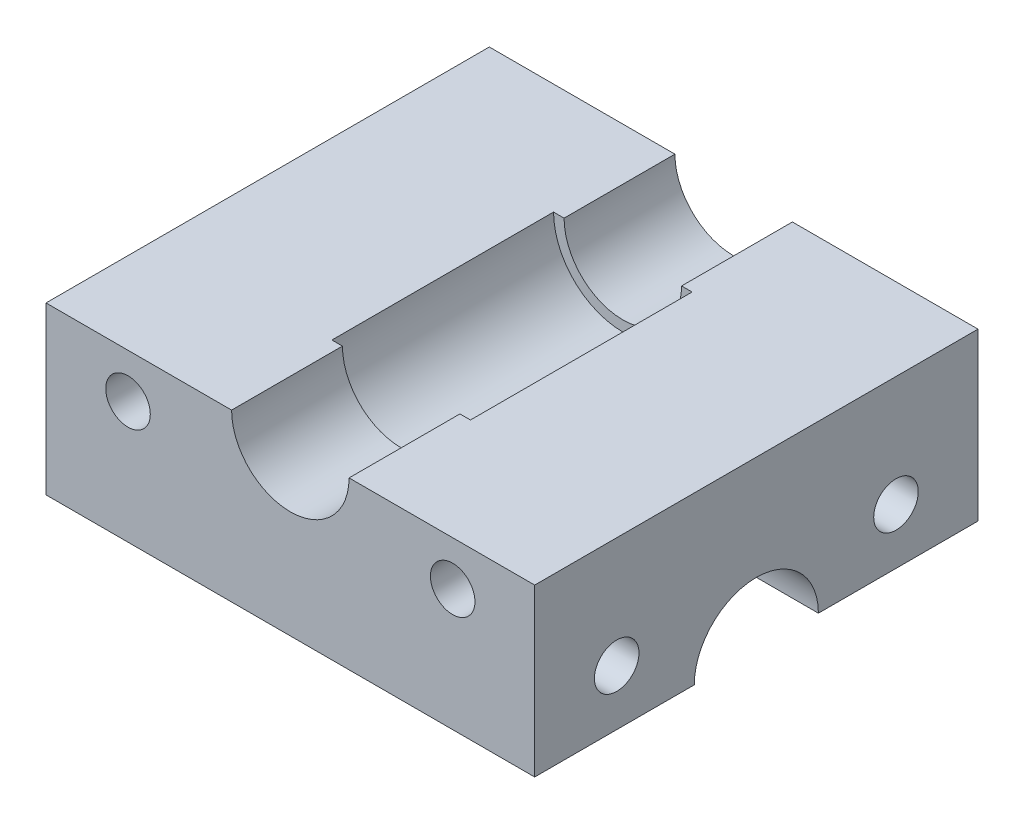
ISO-10303-21;
HEADER;
FILE_DESCRIPTION(('STEP AP214'),'2;1');
FILE_NAME('part.step','',(''),(''),'','','');
FILE_SCHEMA(('AUTOMOTIVE_DESIGN { 1 0 10303 214 1 1 1 1 }'));
ENDSEC;
DATA;
#1=APPLICATION_CONTEXT('core data for automotive mechanical design processes');
#2=APPLICATION_PROTOCOL_DEFINITION('international standard','automotive_design',2000,#1);
#3=PRODUCT_CONTEXT('',#1,'mechanical');
#4=PRODUCT('Part','Part','',(#3));
#5=PRODUCT_RELATED_PRODUCT_CATEGORY('part','',(#4));
#6=PRODUCT_DEFINITION_FORMATION('','',#4);
#7=PRODUCT_DEFINITION_CONTEXT('part definition',#1,'design');
#8=PRODUCT_DEFINITION('design','',#6,#7);
#9=PRODUCT_DEFINITION_SHAPE('','',#8);
#10=(LENGTH_UNIT() NAMED_UNIT(*) SI_UNIT(.MILLI.,.METRE.));
#11=(NAMED_UNIT(*) PLANE_ANGLE_UNIT() SI_UNIT($,.RADIAN.));
#12=(NAMED_UNIT(*) SI_UNIT($,.STERADIAN.) SOLID_ANGLE_UNIT());
#13=UNCERTAINTY_MEASURE_WITH_UNIT(LENGTH_MEASURE(1.E-05),#10,'distance_accuracy_value','');
#14=(GEOMETRIC_REPRESENTATION_CONTEXT(3) GLOBAL_UNCERTAINTY_ASSIGNED_CONTEXT((#13)) GLOBAL_UNIT_ASSIGNED_CONTEXT((#10,
#11,#12)) REPRESENTATION_CONTEXT('',''));
#15=CARTESIAN_POINT('',(0.,0.,0.));
#16=DIRECTION('',(0.,0.,1.));
#17=DIRECTION('',(1.,0.,0.));
#18=AXIS2_PLACEMENT_3D('',#15,#16,#17);
#19=CARTESIAN_POINT('',(-10.9940298507463,-2.47667711691045,50.8));
#20=DIRECTION('',(0.,1.,0.));
#21=DIRECTION('',(0.,0.,1.));
#22=AXIS2_PLACEMENT_3D('',#19,#20,#21);
#23=PLANE('',#22);
#24=DIRECTION('',(0.,0.,-1.));
#25=VECTOR('',#24,1.);
#26=CARTESIAN_POINT('',(-10.9940298507463,-2.47667711691045,50.8));
#27=LINE('',#26,#25);
#28=CARTESIAN_POINT('',(-10.9940298507463,-2.47667711691045,50.8));
#29=VERTEX_POINT('',#28);
#30=CARTESIAN_POINT('',(-10.9940298507463,-2.47667711691045,32.512));
#31=VERTEX_POINT('',#30);
#32=EDGE_CURVE('E132',#29,#31,#27,.T.);
#33=ORIENTED_EDGE('',*,*,#32,.T.);
#34=DIRECTION('',(1.,0.,0.));
#35=VECTOR('',#34,1.);
#36=CARTESIAN_POINT('',(-10.9940298507463,-2.47667711691045,32.512));
#37=LINE('',#36,#35);
#38=CARTESIAN_POINT('',(45.0059701492537,-2.47667711691045,32.512));
#39=VERTEX_POINT('',#38);
#40=EDGE_CURVE('E118',#31,#39,#37,.T.);
#41=ORIENTED_EDGE('',*,*,#40,.T.);
#42=DIRECTION('',(0.,0.,-1.));
#43=VECTOR('',#42,1.);
#44=CARTESIAN_POINT('',(45.0059701492537,-2.47667711691045,50.8));
#45=LINE('',#44,#43);
#46=CARTESIAN_POINT('',(45.0059701492537,-2.47667711691045,50.8));
#47=VERTEX_POINT('',#46);
#48=EDGE_CURVE('E142',#47,#39,#45,.T.);
#49=ORIENTED_EDGE('',*,*,#48,.F.);
#50=DIRECTION('',(1.,0.,0.));
#51=VECTOR('',#50,1.);
#52=CARTESIAN_POINT('',(-10.9940298507463,-2.47667711691045,50.8));
#53=LINE('',#52,#51);
#54=EDGE_CURVE('E136',#29,#47,#53,.T.);
#55=ORIENTED_EDGE('',*,*,#54,.F.);
#56=EDGE_LOOP('',(#33,#41,#49,#55));
#57=FACE_BOUND('',#56,.T.);
#58=ADVANCED_FACE('F32',(#57),#23,.F.);
#59=CARTESIAN_POINT('',(23.7369701492537,16.5733228830895,50.8));
#60=DIRECTION('',(0.,-1.,0.));
#61=DIRECTION('',(0.,0.,-1.));
#62=AXIS2_PLACEMENT_3D('',#59,#60,#61);
#63=PLANE('',#62);
#64=DIRECTION('',(-1.,0.,0.));
#65=VECTOR('',#64,1.);
#66=CARTESIAN_POINT('',(23.7369701492537,16.5733228830895,12.7));
#67=LINE('',#66,#65);
#68=CARTESIAN_POINT('',(24.9434701492537,16.5733228830895,12.7));
#69=VERTEX_POINT('',#68);
#70=CARTESIAN_POINT('',(23.7369701492537,16.5733228830895,12.7));
#71=VERTEX_POINT('',#70);
#72=EDGE_CURVE('E174',#69,#71,#67,.T.);
#73=ORIENTED_EDGE('',*,*,#72,.F.);
#74=DIRECTION('',(0.,0.,1.));
#75=VECTOR('',#74,1.);
#76=CARTESIAN_POINT('',(24.9434701492537,16.5733228830895,12.7));
#77=LINE('',#76,#75);
#78=CARTESIAN_POINT('',(24.9434701492537,16.5733228830895,38.1));
#79=VERTEX_POINT('',#78);
#80=EDGE_CURVE('E157',#69,#79,#77,.T.);
#81=ORIENTED_EDGE('',*,*,#80,.T.);
#82=DIRECTION('',(-1.,0.,0.));
#83=VECTOR('',#82,1.);
#84=CARTESIAN_POINT('',(23.7369701492537,16.5733228830895,38.1));
#85=LINE('',#84,#83);
#86=CARTESIAN_POINT('',(23.7369701492537,16.5733228830895,38.1));
#87=VERTEX_POINT('',#86);
#88=EDGE_CURVE('E163',#79,#87,#85,.T.);
#89=ORIENTED_EDGE('',*,*,#88,.T.);
#90=DIRECTION('',(0.,0.,-1.));
#91=VECTOR('',#90,1.);
#92=CARTESIAN_POINT('',(23.7369701492537,16.5733228830895,50.8));
#93=LINE('',#92,#91);
#94=CARTESIAN_POINT('',(23.7369701492537,16.5733228830895,50.8));
#95=VERTEX_POINT('',#94);
#96=EDGE_CURVE('E210',#95,#87,#93,.T.);
#97=ORIENTED_EDGE('',*,*,#96,.F.);
#98=DIRECTION('',(-1.,0.,0.));
#99=VECTOR('',#98,1.);
#100=CARTESIAN_POINT('',(23.7369701492537,16.5733228830895,50.8));
#101=LINE('',#100,#99);
#102=CARTESIAN_POINT('',(45.0059701492537,16.5733228830895,50.8));
#103=VERTEX_POINT('',#102);
#104=EDGE_CURVE('E184',#103,#95,#101,.T.);
#105=ORIENTED_EDGE('',*,*,#104,.F.);
#106=DIRECTION('',(0.,0.,-1.));
#107=VECTOR('',#106,1.);
#108=CARTESIAN_POINT('',(45.0059701492537,16.5733228830895,50.8));
#109=LINE('',#108,#107);
#110=CARTESIAN_POINT('',(45.0059701492537,16.5733228830895,0.));
#111=VERTEX_POINT('',#110);
#112=EDGE_CURVE('E212',#103,#111,#109,.T.);
#113=ORIENTED_EDGE('',*,*,#112,.T.);
#114=DIRECTION('',(-1.,0.,0.));
#115=VECTOR('',#114,1.);
#116=CARTESIAN_POINT('',(23.7369701492537,16.5733228830895,0.));
#117=LINE('',#116,#115);
#118=CARTESIAN_POINT('',(23.7369701492537,16.5733228830895,0.));
#119=VERTEX_POINT('',#118);
#120=EDGE_CURVE('E197',#111,#119,#117,.T.);
#121=ORIENTED_EDGE('',*,*,#120,.T.);
#122=EDGE_CURVE('E209',#71,#119,#93,.T.);
#123=ORIENTED_EDGE('',*,*,#122,.F.);
#124=EDGE_LOOP('',(#73,#81,#89,#97,#105,#113,#121,#123));
#125=FACE_BOUND('',#124,.T.);
#126=ADVANCED_FACE('F281',(#125),#63,.F.);
#127=CARTESIAN_POINT('',(17.0059701492537,16.5733228830895,50.8));
#128=DIRECTION('',(0.,0.,-1.));
#129=DIRECTION('',(-1.,0.,0.));
#130=AXIS2_PLACEMENT_3D('',#127,#128,#129);
#131=CYLINDRICAL_SURFACE('',#130,6.731);
#132=CARTESIAN_POINT('',(17.0059701492537,16.5733228830895,12.7));
#133=DIRECTION('',(0.,0.,1.));
#134=DIRECTION('',(1.,0.,0.));
#135=AXIS2_PLACEMENT_3D('',#132,#133,#134);
#136=CIRCLE('',#135,6.731);
#137=CARTESIAN_POINT('',(10.2749701492537,16.5733228830895,12.7));
#138=VERTEX_POINT('',#137);
#139=EDGE_CURVE('E172',#71,#138,#136,.F.);
#140=ORIENTED_EDGE('',*,*,#139,.F.);
#141=ORIENTED_EDGE('',*,*,#122,.T.);
#142=CARTESIAN_POINT('',(17.0059701492537,16.5733228830895,0.));
#143=DIRECTION('',(0.,0.,-1.));
#144=DIRECTION('',(-1.,0.,0.));
#145=AXIS2_PLACEMENT_3D('',#142,#143,#144);
#146=CIRCLE('',#145,6.731);
#147=CARTESIAN_POINT('',(10.2749701492537,16.5733228830895,0.));
#148=VERTEX_POINT('',#147);
#149=EDGE_CURVE('E200',#119,#148,#146,.T.);
#150=ORIENTED_EDGE('',*,*,#149,.T.);
#151=DIRECTION('',(0.,0.,-1.));
#152=VECTOR('',#151,1.);
#153=CARTESIAN_POINT('',(10.2749701492537,16.5733228830895,50.8));
#154=LINE('',#153,#152);
#155=EDGE_CURVE('E206',#138,#148,#154,.T.);
#156=ORIENTED_EDGE('',*,*,#155,.F.);
#157=EDGE_LOOP('',(#140,#141,#150,#156));
#158=FACE_BOUND('',#157,.T.);
#159=ADVANCED_FACE('F285',(#158),#131,.F.);
#160=CARTESIAN_POINT('',(-10.9940298507463,16.5733228830895,50.8));
#161=DIRECTION('',(0.,-1.,0.));
#162=DIRECTION('',(0.,0.,-1.));
#163=AXIS2_PLACEMENT_3D('',#160,#161,#162);
#164=PLANE('',#163);
#165=DIRECTION('',(-1.,0.,0.));
#166=VECTOR('',#165,1.);
#167=CARTESIAN_POINT('',(-10.9940298507463,16.5733228830895,12.7));
#168=LINE('',#167,#166);
#169=CARTESIAN_POINT('',(9.06847014925373,16.5733228830895,12.7));
#170=VERTEX_POINT('',#169);
#171=EDGE_CURVE('E11',#138,#170,#168,.T.);
#172=ORIENTED_EDGE('',*,*,#171,.F.);
#173=ORIENTED_EDGE('',*,*,#155,.T.);
#174=DIRECTION('',(-1.,0.,0.));
#175=VECTOR('',#174,1.);
#176=CARTESIAN_POINT('',(-10.9940298507463,16.5733228830895,0.));
#177=LINE('',#176,#175);
#178=CARTESIAN_POINT('',(-10.9940298507463,16.5733228830895,0.));
#179=VERTEX_POINT('',#178);
#180=EDGE_CURVE('E180',#148,#179,#177,.T.);
#181=ORIENTED_EDGE('',*,*,#180,.T.);
#182=DIRECTION('',(0.,0.,-1.));
#183=VECTOR('',#182,1.);
#184=CARTESIAN_POINT('',(-10.9940298507463,16.5733228830895,50.8));
#185=LINE('',#184,#183);
#186=CARTESIAN_POINT('',(-10.9940298507463,16.5733228830895,50.8));
#187=VERTEX_POINT('',#186);
#188=EDGE_CURVE('E190',#187,#179,#185,.T.);
#189=ORIENTED_EDGE('',*,*,#188,.F.);
#190=DIRECTION('',(-1.,0.,0.));
#191=VECTOR('',#190,1.);
#192=CARTESIAN_POINT('',(-10.9940298507463,16.5733228830895,50.8));
#193=LINE('',#192,#191);
#194=CARTESIAN_POINT('',(10.2749701492537,16.5733228830895,50.8));
#195=VERTEX_POINT('',#194);
#196=EDGE_CURVE('E188',#195,#187,#193,.T.);
#197=ORIENTED_EDGE('',*,*,#196,.F.);
#198=CARTESIAN_POINT('',(10.2749701492537,16.5733228830895,38.1));
#199=VERTEX_POINT('',#198);
#200=EDGE_CURVE('E207',#195,#199,#154,.T.);
#201=ORIENTED_EDGE('',*,*,#200,.T.);
#202=DIRECTION('',(-1.,0.,0.));
#203=VECTOR('',#202,1.);
#204=CARTESIAN_POINT('',(-10.9940298507463,16.5733228830895,38.1));
#205=LINE('',#204,#203);
#206=CARTESIAN_POINT('',(9.06847014925374,16.5733228830895,38.1));
#207=VERTEX_POINT('',#206);
#208=EDGE_CURVE('E138',#199,#207,#205,.T.);
#209=ORIENTED_EDGE('',*,*,#208,.T.);
#210=DIRECTION('',(0.,0.,1.));
#211=VECTOR('',#210,1.);
#212=CARTESIAN_POINT('',(9.06847014925373,16.5733228830895,12.7));
#213=LINE('',#212,#211);
#214=EDGE_CURVE('E40',#207,#170,#213,.F.);
#215=ORIENTED_EDGE('',*,*,#214,.T.);
#216=EDGE_LOOP('',(#172,#173,#181,#189,#197,#201,#209,#215));
#217=FACE_BOUND('',#216,.T.);
#218=ADVANCED_FACE('F148',(#217),#164,.F.);
#219=CARTESIAN_POINT('',(-10.9940298507463,-2.47667711691045,50.8));
#220=DIRECTION('',(1.,0.,0.));
#221=DIRECTION('',(0.,0.,-1.));
#222=AXIS2_PLACEMENT_3D('',#219,#220,#221);
#223=PLANE('',#222);
#224=CARTESIAN_POINT('',(-10.9940298507463,3.87332288308955,41.402));
#225=DIRECTION('',(-1.,0.,0.));
#226=DIRECTION('',(0.,0.,1.));
#227=AXIS2_PLACEMENT_3D('',#224,#225,#226);
#228=CIRCLE('',#227,2.55269999999999);
#229=CARTESIAN_POINT('',(-10.9940298507463,3.87332288308955,43.9547));
#230=VERTEX_POINT('',#229);
#231=EDGE_CURVE('E237',#230,#230,#228,.T.);
#232=ORIENTED_EDGE('',*,*,#231,.F.);
#233=EDGE_LOOP('',(#232));
#234=FACE_BOUND('',#233,.T.);
#235=CARTESIAN_POINT('',(-10.9940298507463,3.87332288308955,9.398));
#236=DIRECTION('',(-1.,0.,0.));
#237=DIRECTION('',(0.,0.,1.));
#238=AXIS2_PLACEMENT_3D('',#235,#236,#237);
#239=CIRCLE('',#238,2.55269999999999);
#240=CARTESIAN_POINT('',(-10.9940298507463,3.87332288308955,11.9507));
#241=VERTEX_POINT('',#240);
#242=EDGE_CURVE('E257',#241,#241,#239,.T.);
#243=ORIENTED_EDGE('',*,*,#242,.F.);
#244=EDGE_LOOP('',(#243));
#245=FACE_BOUND('',#244,.T.);
#246=CARTESIAN_POINT('',(-10.9940298507463,-2.47667711691045,18.288));
#247=VERTEX_POINT('',#246);
#248=CARTESIAN_POINT('',(-10.9940298507463,-2.47667711691045,0.));
#249=VERTEX_POINT('',#248);
#250=EDGE_CURVE('E134',#247,#249,#27,.T.);
#251=ORIENTED_EDGE('',*,*,#250,.F.);
#252=CARTESIAN_POINT('',(-10.9940298507463,-2.47667711691045,25.4));
#253=DIRECTION('',(1.,0.,0.));
#254=DIRECTION('',(0.,0.,-1.));
#255=AXIS2_PLACEMENT_3D('',#252,#253,#254);
#256=CIRCLE('',#255,7.112);
#257=EDGE_CURVE('E121',#247,#31,#256,.T.);
#258=ORIENTED_EDGE('',*,*,#257,.T.);
#259=ORIENTED_EDGE('',*,*,#32,.F.);
#260=DIRECTION('',(0.,-1.,0.));
#261=VECTOR('',#260,1.);
#262=CARTESIAN_POINT('',(-10.9940298507463,-2.47667711691045,50.8));
#263=LINE('',#262,#261);
#264=EDGE_CURVE('E178',#187,#29,#263,.T.);
#265=ORIENTED_EDGE('',*,*,#264,.F.);
#266=ORIENTED_EDGE('',*,*,#188,.T.);
#267=DIRECTION('',(0.,-1.,0.));
#268=VECTOR('',#267,1.);
#269=CARTESIAN_POINT('',(-10.9940298507463,-2.47667711691045,0.));
#270=LINE('',#269,#268);
#271=EDGE_CURVE('E177',#179,#249,#270,.T.);
#272=ORIENTED_EDGE('',*,*,#271,.T.);
#273=EDGE_LOOP('',(#251,#258,#259,#265,#266,#272));
#274=FACE_BOUND('',#273,.T.);
#275=ADVANCED_FACE('F34',(#234,#245,#274),#223,.F.);
#276=CARTESIAN_POINT('',(45.0059701492537,-2.47667711691045,18.288));
#277=VERTEX_POINT('',#276);
#278=CARTESIAN_POINT('',(45.0059701492537,-2.47667711691045,0.));
#279=VERTEX_POINT('',#278);
#280=EDGE_CURVE('E214',#277,#279,#45,.T.);
#281=ORIENTED_EDGE('',*,*,#280,.F.);
#282=DIRECTION('',(1.,0.,0.));
#283=VECTOR('',#282,1.);
#284=CARTESIAN_POINT('',(-10.9940298507463,-2.47667711691045,18.288));
#285=LINE('',#284,#283);
#286=EDGE_CURVE('E47',#247,#277,#285,.T.);
#287=ORIENTED_EDGE('',*,*,#286,.F.);
#288=ORIENTED_EDGE('',*,*,#250,.T.);
#289=DIRECTION('',(1.,0.,0.));
#290=VECTOR('',#289,1.);
#291=CARTESIAN_POINT('',(-10.9940298507463,-2.47667711691045,0.));
#292=LINE('',#291,#290);
#293=EDGE_CURVE('E192',#249,#279,#292,.T.);
#294=ORIENTED_EDGE('',*,*,#293,.T.);
#295=EDGE_LOOP('',(#281,#287,#288,#294));
#296=FACE_BOUND('',#295,.T.);
#297=ADVANCED_FACE('F236',(#296),#23,.F.);
#298=CARTESIAN_POINT('',(45.0059701492537,-2.47667711691045,50.8));
#299=DIRECTION('',(-1.,0.,0.));
#300=DIRECTION('',(0.,0.,1.));
#301=AXIS2_PLACEMENT_3D('',#298,#299,#300);
#302=PLANE('',#301);
#303=CARTESIAN_POINT('',(45.0059701492537,3.87332288308955,41.402));
#304=DIRECTION('',(-1.,0.,0.));
#305=DIRECTION('',(0.,0.,1.));
#306=AXIS2_PLACEMENT_3D('',#303,#304,#305);
#307=CIRCLE('',#306,2.55269999999999);
#308=CARTESIAN_POINT('',(45.0059701492537,3.87332288308955,43.9547));
#309=VERTEX_POINT('',#308);
#310=EDGE_CURVE('E240',#309,#309,#307,.T.);
#311=ORIENTED_EDGE('',*,*,#310,.T.);
#312=EDGE_LOOP('',(#311));
#313=FACE_BOUND('',#312,.T.);
#314=CARTESIAN_POINT('',(45.0059701492537,3.87332288308955,9.398));
#315=DIRECTION('',(-1.,0.,0.));
#316=DIRECTION('',(0.,0.,1.));
#317=AXIS2_PLACEMENT_3D('',#314,#315,#316);
#318=CIRCLE('',#317,2.55269999999999);
#319=CARTESIAN_POINT('',(45.0059701492537,3.87332288308955,11.9507));
#320=VERTEX_POINT('',#319);
#321=EDGE_CURVE('E165',#320,#320,#318,.T.);
#322=ORIENTED_EDGE('',*,*,#321,.T.);
#323=EDGE_LOOP('',(#322));
#324=FACE_BOUND('',#323,.T.);
#325=ORIENTED_EDGE('',*,*,#48,.T.);
#326=CARTESIAN_POINT('',(45.0059701492537,-2.47667711691045,25.4));
#327=DIRECTION('',(1.,0.,0.));
#328=DIRECTION('',(0.,0.,-1.));
#329=AXIS2_PLACEMENT_3D('',#326,#327,#328);
#330=CIRCLE('',#329,7.112);
#331=EDGE_CURVE('E122',#277,#39,#330,.T.);
#332=ORIENTED_EDGE('',*,*,#331,.F.);
#333=ORIENTED_EDGE('',*,*,#280,.T.);
#334=DIRECTION('',(0.,1.,0.));
#335=VECTOR('',#334,1.);
#336=CARTESIAN_POINT('',(45.0059701492537,-2.47667711691045,0.));
#337=LINE('',#336,#335);
#338=EDGE_CURVE('E195',#279,#111,#337,.T.);
#339=ORIENTED_EDGE('',*,*,#338,.T.);
#340=ORIENTED_EDGE('',*,*,#112,.F.);
#341=DIRECTION('',(0.,1.,0.));
#342=VECTOR('',#341,1.);
#343=CARTESIAN_POINT('',(45.0059701492537,-2.47667711691045,50.8));
#344=LINE('',#343,#342);
#345=EDGE_CURVE('E182',#47,#103,#344,.T.);
#346=ORIENTED_EDGE('',*,*,#345,.F.);
#347=EDGE_LOOP('',(#325,#332,#333,#339,#340,#346));
#348=FACE_BOUND('',#347,.T.);
#349=ADVANCED_FACE('F222',(#313,#324,#348),#302,.F.);
#350=ORIENTED_EDGE('',*,*,#96,.T.);
#351=CARTESIAN_POINT('',(17.0059701492537,16.5733228830895,38.1));
#352=DIRECTION('',(0.,0.,1.));
#353=DIRECTION('',(1.,0.,0.));
#354=AXIS2_PLACEMENT_3D('',#351,#352,#353);
#355=CIRCLE('',#354,6.731);
#356=EDGE_CURVE('E160',#87,#199,#355,.F.);
#357=ORIENTED_EDGE('',*,*,#356,.T.);
#358=ORIENTED_EDGE('',*,*,#200,.F.);
#359=CARTESIAN_POINT('',(17.0059701492537,16.5733228830895,50.8));
#360=DIRECTION('',(0.,0.,-1.));
#361=DIRECTION('',(-1.,0.,0.));
#362=AXIS2_PLACEMENT_3D('',#359,#360,#361);
#363=CIRCLE('',#362,6.731);
#364=EDGE_CURVE('E186',#95,#195,#363,.T.);
#365=ORIENTED_EDGE('',*,*,#364,.F.);
#366=EDGE_LOOP('',(#350,#357,#358,#365));
#367=FACE_BOUND('',#366,.T.);
#368=ADVANCED_FACE('F293',(#367),#131,.F.);
#369=CARTESIAN_POINT('',(17.0059701492537,16.5733228830895,50.8));
#370=DIRECTION('',(0.,0.,-1.));
#371=DIRECTION('',(-1.,0.,0.));
#372=AXIS2_PLACEMENT_3D('',#369,#370,#371);
#373=PLANE('',#372);
#374=CARTESIAN_POINT('',(-1.59602985074627,11.4933228830896,50.8));
#375=DIRECTION('',(0.,0.,1.));
#376=DIRECTION('',(1.,0.,0.));
#377=AXIS2_PLACEMENT_3D('',#374,#375,#376);
#378=CIRCLE('',#377,2.55269999999999);
#379=CARTESIAN_POINT('',(0.95667014925372,11.4933228830896,50.8));
#380=VERTEX_POINT('',#379);
#381=EDGE_CURVE('E246',#380,#380,#378,.T.);
#382=ORIENTED_EDGE('',*,*,#381,.F.);
#383=EDGE_LOOP('',(#382));
#384=FACE_BOUND('',#383,.T.);
#385=CARTESIAN_POINT('',(35.6079701492537,11.4933228830896,50.8));
#386=DIRECTION('',(0.,0.,1.));
#387=DIRECTION('',(1.,0.,0.));
#388=AXIS2_PLACEMENT_3D('',#385,#386,#387);
#389=CIRCLE('',#388,2.55269999999999);
#390=CARTESIAN_POINT('',(38.1606701492537,11.4933228830896,50.8));
#391=VERTEX_POINT('',#390);
#392=EDGE_CURVE('E252',#391,#391,#389,.T.);
#393=ORIENTED_EDGE('',*,*,#392,.F.);
#394=EDGE_LOOP('',(#393));
#395=FACE_BOUND('',#394,.T.);
#396=ORIENTED_EDGE('',*,*,#264,.T.);
#397=ORIENTED_EDGE('',*,*,#54,.T.);
#398=ORIENTED_EDGE('',*,*,#345,.T.);
#399=ORIENTED_EDGE('',*,*,#104,.T.);
#400=ORIENTED_EDGE('',*,*,#364,.T.);
#401=ORIENTED_EDGE('',*,*,#196,.T.);
#402=EDGE_LOOP('',(#396,#397,#398,#399,#400,#401));
#403=FACE_BOUND('',#402,.T.);
#404=ADVANCED_FACE('F224',(#384,#395,#403),#373,.F.);
#405=CARTESIAN_POINT('',(17.0059701492537,16.5733228830895,0.));
#406=DIRECTION('',(0.,0.,-1.));
#407=DIRECTION('',(-1.,0.,0.));
#408=AXIS2_PLACEMENT_3D('',#405,#406,#407);
#409=PLANE('',#408);
#410=CARTESIAN_POINT('',(-1.59602985074627,11.4933228830896,0.));
#411=DIRECTION('',(0.,0.,1.));
#412=DIRECTION('',(1.,0.,0.));
#413=AXIS2_PLACEMENT_3D('',#410,#411,#412);
#414=CIRCLE('',#413,2.55269999999999);
#415=CARTESIAN_POINT('',(0.95667014925372,11.4933228830896,0.));
#416=VERTEX_POINT('',#415);
#417=EDGE_CURVE('E249',#416,#416,#414,.T.);
#418=ORIENTED_EDGE('',*,*,#417,.T.);
#419=EDGE_LOOP('',(#418));
#420=FACE_BOUND('',#419,.T.);
#421=CARTESIAN_POINT('',(35.6079701492537,11.4933228830896,0.));
#422=DIRECTION('',(0.,0.,1.));
#423=DIRECTION('',(1.,0.,0.));
#424=AXIS2_PLACEMENT_3D('',#421,#422,#423);
#425=CIRCLE('',#424,2.55269999999998);
#426=CARTESIAN_POINT('',(38.1606701492537,11.4933228830896,0.));
#427=VERTEX_POINT('',#426);
#428=EDGE_CURVE('E255',#427,#427,#425,.T.);
#429=ORIENTED_EDGE('',*,*,#428,.T.);
#430=EDGE_LOOP('',(#429));
#431=FACE_BOUND('',#430,.T.);
#432=ORIENTED_EDGE('',*,*,#271,.F.);
#433=ORIENTED_EDGE('',*,*,#180,.F.);
#434=ORIENTED_EDGE('',*,*,#149,.F.);
#435=ORIENTED_EDGE('',*,*,#120,.F.);
#436=ORIENTED_EDGE('',*,*,#338,.F.);
#437=ORIENTED_EDGE('',*,*,#293,.F.);
#438=EDGE_LOOP('',(#432,#433,#434,#435,#436,#437));
#439=FACE_BOUND('',#438,.T.);
#440=ADVANCED_FACE('F232',(#420,#431,#439),#409,.T.);
#441=CARTESIAN_POINT('',(17.0059701492537,16.5733228830895,12.7));
#442=DIRECTION('',(0.,0.,1.));
#443=DIRECTION('',(1.,0.,0.));
#444=AXIS2_PLACEMENT_3D('',#441,#442,#443);
#445=CYLINDRICAL_SURFACE('',#444,7.9375);
#446=CARTESIAN_POINT('',(17.0059701492537,16.5733228830895,12.7));
#447=DIRECTION('',(0.,0.,1.));
#448=DIRECTION('',(1.,0.,0.));
#449=AXIS2_PLACEMENT_3D('',#446,#447,#448);
#450=CIRCLE('',#449,7.9375);
#451=EDGE_CURVE('E156',#170,#69,#450,.T.);
#452=ORIENTED_EDGE('',*,*,#451,.F.);
#453=ORIENTED_EDGE('',*,*,#214,.F.);
#454=CARTESIAN_POINT('',(17.0059701492537,16.5733228830895,38.1));
#455=DIRECTION('',(0.,0.,1.));
#456=DIRECTION('',(1.,0.,0.));
#457=AXIS2_PLACEMENT_3D('',#454,#455,#456);
#458=CIRCLE('',#457,7.9375);
#459=EDGE_CURVE('E55',#207,#79,#458,.T.);
#460=ORIENTED_EDGE('',*,*,#459,.T.);
#461=ORIENTED_EDGE('',*,*,#80,.F.);
#462=EDGE_LOOP('',(#452,#453,#460,#461));
#463=FACE_BOUND('',#462,.T.);
#464=ADVANCED_FACE('F153',(#463),#445,.F.);
#465=CARTESIAN_POINT('',(17.0059701492537,16.5733228830895,12.7));
#466=DIRECTION('',(0.,0.,1.));
#467=DIRECTION('',(1.,0.,0.));
#468=AXIS2_PLACEMENT_3D('',#465,#466,#467);
#469=PLANE('',#468);
#470=ORIENTED_EDGE('',*,*,#72,.T.);
#471=ORIENTED_EDGE('',*,*,#139,.T.);
#472=ORIENTED_EDGE('',*,*,#171,.T.);
#473=ORIENTED_EDGE('',*,*,#451,.T.);
#474=EDGE_LOOP('',(#470,#471,#472,#473));
#475=FACE_BOUND('',#474,.T.);
#476=ADVANCED_FACE('F277',(#475),#469,.T.);
#477=CARTESIAN_POINT('',(17.0059701492537,16.5733228830895,38.1));
#478=DIRECTION('',(0.,0.,1.));
#479=DIRECTION('',(1.,0.,0.));
#480=AXIS2_PLACEMENT_3D('',#477,#478,#479);
#481=PLANE('',#480);
#482=ORIENTED_EDGE('',*,*,#459,.F.);
#483=ORIENTED_EDGE('',*,*,#208,.F.);
#484=ORIENTED_EDGE('',*,*,#356,.F.);
#485=ORIENTED_EDGE('',*,*,#88,.F.);
#486=EDGE_LOOP('',(#482,#483,#484,#485));
#487=FACE_BOUND('',#486,.T.);
#488=ADVANCED_FACE('F268',(#487),#481,.F.);
#489=CARTESIAN_POINT('',(-10.9940298507463,3.87332288308955,9.398));
#490=DIRECTION('',(-1.,0.,0.));
#491=DIRECTION('',(0.,0.,1.));
#492=AXIS2_PLACEMENT_3D('',#489,#490,#491);
#493=CYLINDRICAL_SURFACE('',#492,2.55269999999999);
#494=ORIENTED_EDGE('',*,*,#321,.F.);
#495=EDGE_LOOP('',(#494));
#496=FACE_BOUND('',#495,.T.);
#497=ORIENTED_EDGE('',*,*,#242,.T.);
#498=EDGE_LOOP('',(#497));
#499=FACE_BOUND('',#498,.T.);
#500=ADVANCED_FACE('F265',(#496,#499),#493,.F.);
#501=CARTESIAN_POINT('',(35.6079701492537,11.4933228830896,50.8));
#502=DIRECTION('',(0.,0.,1.));
#503=DIRECTION('',(1.,0.,0.));
#504=AXIS2_PLACEMENT_3D('',#501,#502,#503);
#505=CYLINDRICAL_SURFACE('',#504,2.55269999999999);
#506=ORIENTED_EDGE('',*,*,#428,.F.);
#507=EDGE_LOOP('',(#506));
#508=FACE_BOUND('',#507,.T.);
#509=ORIENTED_EDGE('',*,*,#392,.T.);
#510=EDGE_LOOP('',(#509));
#511=FACE_BOUND('',#510,.T.);
#512=ADVANCED_FACE('F267',(#508,#511),#505,.F.);
#513=CARTESIAN_POINT('',(-1.59602985074627,11.4933228830896,50.8));
#514=DIRECTION('',(0.,0.,1.));
#515=DIRECTION('',(1.,0.,0.));
#516=AXIS2_PLACEMENT_3D('',#513,#514,#515);
#517=CYLINDRICAL_SURFACE('',#516,2.55269999999999);
#518=ORIENTED_EDGE('',*,*,#417,.F.);
#519=EDGE_LOOP('',(#518));
#520=FACE_BOUND('',#519,.T.);
#521=ORIENTED_EDGE('',*,*,#381,.T.);
#522=EDGE_LOOP('',(#521));
#523=FACE_BOUND('',#522,.T.);
#524=ADVANCED_FACE('F274',(#520,#523),#517,.F.);
#525=CARTESIAN_POINT('',(-10.9940298507463,3.87332288308955,41.402));
#526=DIRECTION('',(-1.,0.,0.));
#527=DIRECTION('',(0.,0.,1.));
#528=AXIS2_PLACEMENT_3D('',#525,#526,#527);
#529=CYLINDRICAL_SURFACE('',#528,2.55269999999999);
#530=ORIENTED_EDGE('',*,*,#310,.F.);
#531=EDGE_LOOP('',(#530));
#532=FACE_BOUND('',#531,.T.);
#533=ORIENTED_EDGE('',*,*,#231,.T.);
#534=EDGE_LOOP('',(#533));
#535=FACE_BOUND('',#534,.T.);
#536=ADVANCED_FACE('F303',(#532,#535),#529,.F.);
#537=CARTESIAN_POINT('',(-10.9940298507463,-2.47667711691045,25.4));
#538=DIRECTION('',(1.,0.,0.));
#539=DIRECTION('',(0.,0.,-1.));
#540=AXIS2_PLACEMENT_3D('',#537,#538,#539);
#541=CYLINDRICAL_SURFACE('',#540,7.112);
#542=ORIENTED_EDGE('',*,*,#331,.T.);
#543=ORIENTED_EDGE('',*,*,#40,.F.);
#544=ORIENTED_EDGE('',*,*,#257,.F.);
#545=ORIENTED_EDGE('',*,*,#286,.T.);
#546=EDGE_LOOP('',(#542,#543,#544,#545));
#547=FACE_BOUND('',#546,.T.);
#548=ADVANCED_FACE('F120',(#547),#541,.F.);
#549=CLOSED_SHELL('',(#58,#126,#159,#218,#275,#297,#349,#368,#404,#440,#464,#476,#488,#500,#512,
#524,#536,#548));
#550=MANIFOLD_SOLID_BREP('B2',#549);
#551=ADVANCED_BREP_SHAPE_REPRESENTATION('',(#18,#550),#14);
#552=SHAPE_DEFINITION_REPRESENTATION(#9,#551);
ENDSEC;
END-ISO-10303-21;
